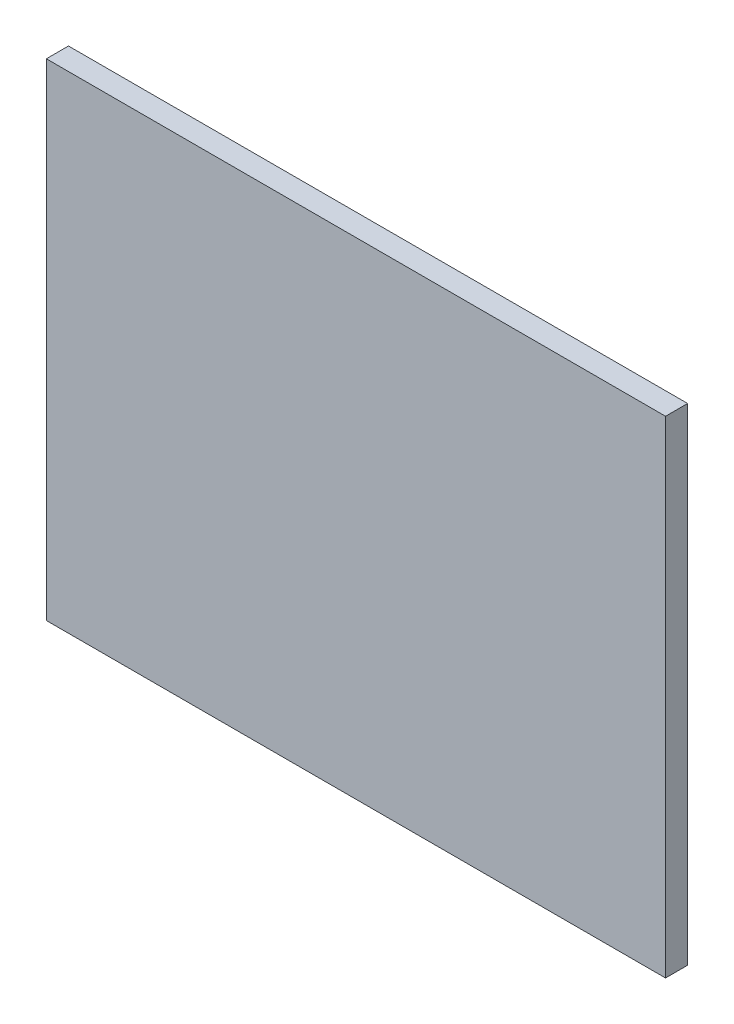
ISO-10303-21;
HEADER;
FILE_DESCRIPTION(('STEP AP214'),'2;1');
FILE_NAME('part.step','',(''),(''),'','','');
FILE_SCHEMA(('AUTOMOTIVE_DESIGN { 1 0 10303 214 1 1 1 1 }'));
ENDSEC;
DATA;
#1=APPLICATION_CONTEXT('core data for automotive mechanical design processes');
#2=APPLICATION_PROTOCOL_DEFINITION('international standard','automotive_design',2000,#1);
#3=PRODUCT_CONTEXT('',#1,'mechanical');
#4=PRODUCT('Part','Part','',(#3));
#5=PRODUCT_RELATED_PRODUCT_CATEGORY('part','',(#4));
#6=PRODUCT_DEFINITION_FORMATION('','',#4);
#7=PRODUCT_DEFINITION_CONTEXT('part definition',#1,'design');
#8=PRODUCT_DEFINITION('design','',#6,#7);
#9=PRODUCT_DEFINITION_SHAPE('','',#8);
#10=(LENGTH_UNIT() NAMED_UNIT(*) SI_UNIT(.MILLI.,.METRE.));
#11=(NAMED_UNIT(*) PLANE_ANGLE_UNIT() SI_UNIT($,.RADIAN.));
#12=(NAMED_UNIT(*) SI_UNIT($,.STERADIAN.) SOLID_ANGLE_UNIT());
#13=UNCERTAINTY_MEASURE_WITH_UNIT(LENGTH_MEASURE(1.E-05),#10,'distance_accuracy_value','');
#14=(GEOMETRIC_REPRESENTATION_CONTEXT(3) GLOBAL_UNCERTAINTY_ASSIGNED_CONTEXT((#13)) GLOBAL_UNIT_ASSIGNED_CONTEXT((#10,
#11,#12)) REPRESENTATION_CONTEXT('',''));
#15=CARTESIAN_POINT('',(0.,0.,0.));
#16=DIRECTION('',(0.,0.,1.));
#17=DIRECTION('',(1.,0.,0.));
#18=AXIS2_PLACEMENT_3D('',#15,#16,#17);
#19=CARTESIAN_POINT('',(-115.501519756839,-122.036474164134,10.));
#20=DIRECTION('',(0.,1.,0.));
#21=DIRECTION('',(0.,0.,1.));
#22=AXIS2_PLACEMENT_3D('',#19,#20,#21);
#23=PLANE('',#22);
#24=DIRECTION('',(1.,0.,0.));
#25=VECTOR('',#24,1.);
#26=CARTESIAN_POINT('',(-115.501519756839,-122.036474164134,0.));
#27=LINE('',#26,#25);
#28=CARTESIAN_POINT('',(-115.501519756839,-122.036474164134,0.));
#29=VERTEX_POINT('',#28);
#30=CARTESIAN_POINT('',(164.498480243161,-122.036474164134,0.));
#31=VERTEX_POINT('',#30);
#32=EDGE_CURVE('E98',#29,#31,#27,.T.);
#33=ORIENTED_EDGE('',*,*,#32,.T.);
#34=DIRECTION('',(0.,0.,-1.));
#35=VECTOR('',#34,1.);
#36=CARTESIAN_POINT('',(164.498480243161,-122.036474164134,10.));
#37=LINE('',#36,#35);
#38=CARTESIAN_POINT('',(164.498480243161,-122.036474164134,10.));
#39=VERTEX_POINT('',#38);
#40=EDGE_CURVE('E11',#39,#31,#37,.T.);
#41=ORIENTED_EDGE('',*,*,#40,.F.);
#42=DIRECTION('',(1.,0.,0.));
#43=VECTOR('',#42,1.);
#44=CARTESIAN_POINT('',(-115.501519756839,-122.036474164134,10.));
#45=LINE('',#44,#43);
#46=CARTESIAN_POINT('',(-115.501519756839,-122.036474164134,10.));
#47=VERTEX_POINT('',#46);
#48=EDGE_CURVE('E75',#47,#39,#45,.T.);
#49=ORIENTED_EDGE('',*,*,#48,.F.);
#50=DIRECTION('',(0.,0.,-1.));
#51=VECTOR('',#50,1.);
#52=CARTESIAN_POINT('',(-115.501519756839,-122.036474164134,10.));
#53=LINE('',#52,#51);
#54=EDGE_CURVE('E94',#47,#29,#53,.T.);
#55=ORIENTED_EDGE('',*,*,#54,.T.);
#56=EDGE_LOOP('',(#33,#41,#49,#55));
#57=FACE_BOUND('',#56,.T.);
#58=ADVANCED_FACE('F36',(#57),#23,.F.);
#59=CARTESIAN_POINT('',(164.498480243161,97.9635258358662,10.));
#60=DIRECTION('',(1.,0.,0.));
#61=DIRECTION('',(0.,0.,-1.));
#62=AXIS2_PLACEMENT_3D('',#59,#60,#61);
#63=PLANE('',#62);
#64=DIRECTION('',(0.,-1.,0.));
#65=VECTOR('',#64,1.);
#66=CARTESIAN_POINT('',(164.498480243161,97.9635258358662,0.));
#67=LINE('',#66,#65);
#68=CARTESIAN_POINT('',(164.498480243161,97.9635258358662,0.));
#69=VERTEX_POINT('',#68);
#70=EDGE_CURVE('E84',#69,#31,#67,.T.);
#71=ORIENTED_EDGE('',*,*,#70,.F.);
#72=DIRECTION('',(0.,0.,-1.));
#73=VECTOR('',#72,1.);
#74=CARTESIAN_POINT('',(164.498480243161,97.9635258358662,10.));
#75=LINE('',#74,#73);
#76=CARTESIAN_POINT('',(164.498480243161,97.9635258358662,10.));
#77=VERTEX_POINT('',#76);
#78=EDGE_CURVE('E44',#77,#69,#75,.T.);
#79=ORIENTED_EDGE('',*,*,#78,.F.);
#80=DIRECTION('',(0.,-1.,0.));
#81=VECTOR('',#80,1.);
#82=CARTESIAN_POINT('',(164.498480243161,97.9635258358662,10.));
#83=LINE('',#82,#81);
#84=EDGE_CURVE('E82',#77,#39,#83,.T.);
#85=ORIENTED_EDGE('',*,*,#84,.T.);
#86=ORIENTED_EDGE('',*,*,#40,.T.);
#87=EDGE_LOOP('',(#71,#79,#85,#86));
#88=FACE_BOUND('',#87,.T.);
#89=ADVANCED_FACE('F81',(#88),#63,.T.);
#90=CARTESIAN_POINT('',(-115.501519756839,97.9635258358662,10.));
#91=DIRECTION('',(0.,1.,0.));
#92=DIRECTION('',(0.,0.,1.));
#93=AXIS2_PLACEMENT_3D('',#90,#91,#92);
#94=PLANE('',#93);
#95=DIRECTION('',(1.,0.,0.));
#96=VECTOR('',#95,1.);
#97=CARTESIAN_POINT('',(-115.501519756839,97.9635258358662,0.));
#98=LINE('',#97,#96);
#99=CARTESIAN_POINT('',(-115.501519756839,97.9635258358662,0.));
#100=VERTEX_POINT('',#99);
#101=EDGE_CURVE('E102',#100,#69,#98,.T.);
#102=ORIENTED_EDGE('',*,*,#101,.F.);
#103=DIRECTION('',(0.,0.,-1.));
#104=VECTOR('',#103,1.);
#105=CARTESIAN_POINT('',(-115.501519756839,97.9635258358662,10.));
#106=LINE('',#105,#104);
#107=CARTESIAN_POINT('',(-115.501519756839,97.9635258358662,10.));
#108=VERTEX_POINT('',#107);
#109=EDGE_CURVE('E67',#108,#100,#106,.T.);
#110=ORIENTED_EDGE('',*,*,#109,.F.);
#111=DIRECTION('',(1.,0.,0.));
#112=VECTOR('',#111,1.);
#113=CARTESIAN_POINT('',(-115.501519756839,97.9635258358662,10.));
#114=LINE('',#113,#112);
#115=EDGE_CURVE('E90',#108,#77,#114,.T.);
#116=ORIENTED_EDGE('',*,*,#115,.T.);
#117=ORIENTED_EDGE('',*,*,#78,.T.);
#118=EDGE_LOOP('',(#102,#110,#116,#117));
#119=FACE_BOUND('',#118,.T.);
#120=ADVANCED_FACE('F92',(#119),#94,.T.);
#121=CARTESIAN_POINT('',(-115.501519756839,97.9635258358662,10.));
#122=DIRECTION('',(1.,0.,0.));
#123=DIRECTION('',(0.,1.,0.));
#124=AXIS2_PLACEMENT_3D('',#121,#122,#123);
#125=PLANE('',#124);
#126=DIRECTION('',(0.,-1.,0.));
#127=VECTOR('',#126,1.);
#128=CARTESIAN_POINT('',(-115.501519756839,97.9635258358662,0.));
#129=LINE('',#128,#127);
#130=EDGE_CURVE('E70',#100,#29,#129,.T.);
#131=ORIENTED_EDGE('',*,*,#130,.T.);
#132=ORIENTED_EDGE('',*,*,#54,.F.);
#133=DIRECTION('',(0.,-1.,0.));
#134=VECTOR('',#133,1.);
#135=CARTESIAN_POINT('',(-115.501519756839,97.9635258358662,10.));
#136=LINE('',#135,#134);
#137=EDGE_CURVE('E52',#108,#47,#136,.T.);
#138=ORIENTED_EDGE('',*,*,#137,.F.);
#139=ORIENTED_EDGE('',*,*,#109,.T.);
#140=EDGE_LOOP('',(#131,#132,#138,#139));
#141=FACE_BOUND('',#140,.T.);
#142=ADVANCED_FACE('F115',(#141),#125,.F.);
#143=CARTESIAN_POINT('',(0.,0.,10.));
#144=DIRECTION('',(0.,0.,-1.));
#145=DIRECTION('',(-1.,0.,0.));
#146=AXIS2_PLACEMENT_3D('',#143,#144,#145);
#147=PLANE('',#146);
#148=ORIENTED_EDGE('',*,*,#48,.T.);
#149=ORIENTED_EDGE('',*,*,#84,.F.);
#150=ORIENTED_EDGE('',*,*,#115,.F.);
#151=ORIENTED_EDGE('',*,*,#137,.T.);
#152=EDGE_LOOP('',(#148,#149,#150,#151));
#153=FACE_BOUND('',#152,.T.);
#154=ADVANCED_FACE('F89',(#153),#147,.F.);
#155=CARTESIAN_POINT('',(0.,0.,0.));
#156=DIRECTION('',(0.,0.,-1.));
#157=DIRECTION('',(-1.,0.,0.));
#158=AXIS2_PLACEMENT_3D('',#155,#156,#157);
#159=PLANE('',#158);
#160=ORIENTED_EDGE('',*,*,#32,.F.);
#161=ORIENTED_EDGE('',*,*,#130,.F.);
#162=ORIENTED_EDGE('',*,*,#101,.T.);
#163=ORIENTED_EDGE('',*,*,#70,.T.);
#164=EDGE_LOOP('',(#160,#161,#162,#163));
#165=FACE_BOUND('',#164,.T.);
#166=ADVANCED_FACE('F109',(#165),#159,.T.);
#167=CLOSED_SHELL('',(#58,#89,#120,#142,#154,#166));
#168=MANIFOLD_SOLID_BREP('B2',#167);
#169=ADVANCED_BREP_SHAPE_REPRESENTATION('',(#18,#168),#14);
#170=SHAPE_DEFINITION_REPRESENTATION(#9,#169);
ENDSEC;
END-ISO-10303-21;
